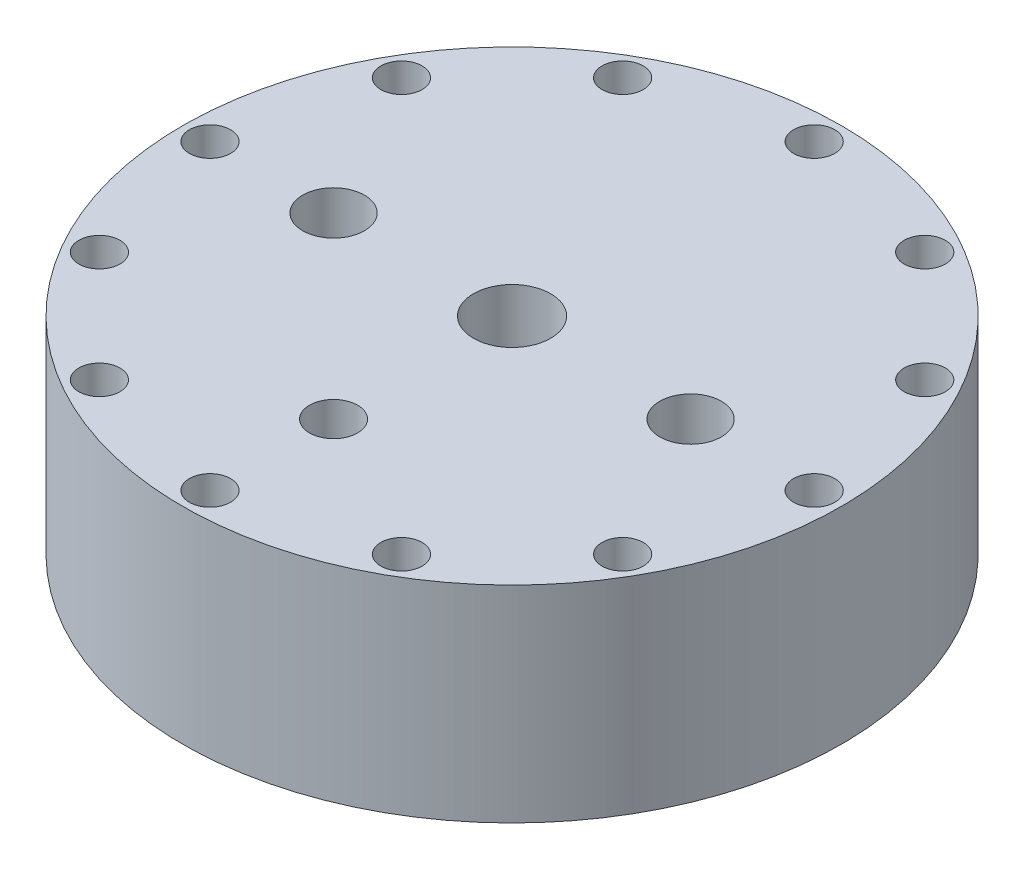
ISO-10303-21;
HEADER;
FILE_DESCRIPTION(('STEP AP214'),'2;1');
FILE_NAME('part.step','',(''),(''),'','','');
FILE_SCHEMA(('AUTOMOTIVE_DESIGN { 1 0 10303 214 1 1 1 1 }'));
ENDSEC;
DATA;
#1=APPLICATION_CONTEXT('core data for automotive mechanical design processes');
#2=APPLICATION_PROTOCOL_DEFINITION('international standard','automotive_design',2000,#1);
#3=PRODUCT_CONTEXT('',#1,'mechanical');
#4=PRODUCT('Part','Part','',(#3));
#5=PRODUCT_RELATED_PRODUCT_CATEGORY('part','',(#4));
#6=PRODUCT_DEFINITION_FORMATION('','',#4);
#7=PRODUCT_DEFINITION_CONTEXT('part definition',#1,'design');
#8=PRODUCT_DEFINITION('design','',#6,#7);
#9=PRODUCT_DEFINITION_SHAPE('','',#8);
#10=(LENGTH_UNIT() NAMED_UNIT(*) SI_UNIT(.MILLI.,.METRE.));
#11=(NAMED_UNIT(*) PLANE_ANGLE_UNIT() SI_UNIT($,.RADIAN.));
#12=(NAMED_UNIT(*) SI_UNIT($,.STERADIAN.) SOLID_ANGLE_UNIT());
#13=UNCERTAINTY_MEASURE_WITH_UNIT(LENGTH_MEASURE(1.E-05),#10,'distance_accuracy_value','');
#14=(GEOMETRIC_REPRESENTATION_CONTEXT(3) GLOBAL_UNCERTAINTY_ASSIGNED_CONTEXT((#13)) GLOBAL_UNIT_ASSIGNED_CONTEXT((#10,
#11,#12)) REPRESENTATION_CONTEXT('',''));
#15=CARTESIAN_POINT('',(0.,0.,0.));
#16=DIRECTION('',(0.,0.,1.));
#17=DIRECTION('',(1.,0.,0.));
#18=AXIS2_PLACEMENT_3D('',#15,#16,#17);
#19=CARTESIAN_POINT('',(0.,0.,0.));
#20=DIRECTION('',(0.,-1.,0.));
#21=DIRECTION('',(0.,0.,-1.));
#22=AXIS2_PLACEMENT_3D('',#19,#20,#21);
#23=PLANE('',#22);
#24=CARTESIAN_POINT('',(0.,0.,41.275));
#25=DIRECTION('',(0.,1.,0.));
#26=DIRECTION('',(0.,0.,1.));
#27=AXIS2_PLACEMENT_3D('',#24,#25,#26);
#28=CIRCLE('',#27,5.5626);
#29=CARTESIAN_POINT('',(0.,0.,46.8376));
#30=VERTEX_POINT('',#29);
#31=EDGE_CURVE('E220',#30,#30,#28,.T.);
#32=ORIENTED_EDGE('',*,*,#31,.F.);
#33=EDGE_LOOP('',(#32));
#34=FACE_BOUND('',#33,.T.);
#35=CARTESIAN_POINT('',(41.275,0.,0.));
#36=DIRECTION('',(0.,1.,0.));
#37=DIRECTION('',(0.,0.,-1.));
#38=AXIS2_PLACEMENT_3D('',#35,#36,#37);
#39=CIRCLE('',#38,7.1374);
#40=CARTESIAN_POINT('',(41.275,0.,-7.1374));
#41=VERTEX_POINT('',#40);
#42=EDGE_CURVE('E212',#41,#41,#39,.T.);
#43=ORIENTED_EDGE('',*,*,#42,.F.);
#44=EDGE_LOOP('',(#43));
#45=FACE_BOUND('',#44,.T.);
#46=CARTESIAN_POINT('',(-41.275,0.,0.));
#47=DIRECTION('',(0.,1.,0.));
#48=DIRECTION('',(0.,0.,1.));
#49=AXIS2_PLACEMENT_3D('',#46,#47,#48);
#50=CIRCLE('',#49,7.1374);
#51=CARTESIAN_POINT('',(-41.275,0.,7.1374));
#52=VERTEX_POINT('',#51);
#53=EDGE_CURVE('E204',#52,#52,#50,.T.);
#54=ORIENTED_EDGE('',*,*,#53,.F.);
#55=EDGE_LOOP('',(#54));
#56=FACE_BOUND('',#55,.T.);
#57=CARTESIAN_POINT('',(0.,0.,0.));
#58=DIRECTION('',(0.,1.,0.));
#59=DIRECTION('',(0.,0.,1.));
#60=AXIS2_PLACEMENT_3D('',#57,#58,#59);
#61=CIRCLE('',#60,8.9281);
#62=CARTESIAN_POINT('',(0.,0.,8.9281));
#63=VERTEX_POINT('',#62);
#64=EDGE_CURVE('E196',#63,#63,#61,.T.);
#65=ORIENTED_EDGE('',*,*,#64,.F.);
#66=EDGE_LOOP('',(#65));
#67=FACE_BOUND('',#66,.T.);
#68=CARTESIAN_POINT('',(-34.9249999999999,0.,-60.4918744543431));
#69=DIRECTION('',(0.,1.,0.));
#70=DIRECTION('',(-0.86602540378444,0.,0.499999999999998));
#71=AXIS2_PLACEMENT_3D('',#68,#69,#70);
#72=CIRCLE('',#71,4.76249999999999);
#73=CARTESIAN_POINT('',(-39.0494459855232,0.,-58.1106244543431));
#74=VERTEX_POINT('',#73);
#75=EDGE_CURVE('E167',#74,#74,#72,.T.);
#76=ORIENTED_EDGE('',*,*,#75,.F.);
#77=EDGE_LOOP('',(#76));
#78=FACE_BOUND('',#77,.T.);
#79=CARTESIAN_POINT('',(2.43879971518193E-13,0.,-69.85));
#80=DIRECTION('',(0.,1.,0.));
#81=DIRECTION('',(-1.,0.,0.));
#82=AXIS2_PLACEMENT_3D('',#79,#80,#81);
#83=CIRCLE('',#82,4.76249999999999);
#84=CARTESIAN_POINT('',(-4.76249999999975,0.,-69.85));
#85=VERTEX_POINT('',#84);
#86=EDGE_CURVE('E159',#85,#85,#83,.T.);
#87=ORIENTED_EDGE('',*,*,#86,.F.);
#88=EDGE_LOOP('',(#87));
#89=FACE_BOUND('',#88,.T.);
#90=CARTESIAN_POINT('',(34.9250000000003,0.,-60.4918744543429));
#91=DIRECTION('',(0.,1.,0.));
#92=DIRECTION('',(-0.866025403784436,0.,-0.500000000000004));
#93=AXIS2_PLACEMENT_3D('',#90,#91,#92);
#94=CIRCLE('',#93,4.76249999999999);
#95=CARTESIAN_POINT('',(30.8005540144769,0.,-62.8731244543429));
#96=VERTEX_POINT('',#95);
#97=EDGE_CURVE('E151',#96,#96,#94,.T.);
#98=ORIENTED_EDGE('',*,*,#97,.F.);
#99=EDGE_LOOP('',(#98));
#100=FACE_BOUND('',#99,.T.);
#101=CARTESIAN_POINT('',(60.4918744543432,0.,-34.9249999999996));
#102=DIRECTION('',(0.,1.,0.));
#103=DIRECTION('',(-0.499999999999995,0.,-0.866025403784442));
#104=AXIS2_PLACEMENT_3D('',#101,#102,#103);
#105=CIRCLE('',#104,4.76249999999999);
#106=CARTESIAN_POINT('',(58.1106244543433,0.,-39.049445985523));
#107=VERTEX_POINT('',#106);
#108=EDGE_CURVE('E143',#107,#107,#105,.T.);
#109=ORIENTED_EDGE('',*,*,#108,.F.);
#110=EDGE_LOOP('',(#109));
#111=FACE_BOUND('',#110,.T.);
#112=CARTESIAN_POINT('',(69.85,0.,0.));
#113=DIRECTION('',(0.,1.,0.));
#114=DIRECTION('',(0.,0.,-1.));
#115=AXIS2_PLACEMENT_3D('',#112,#113,#114);
#116=CIRCLE('',#115,4.76249999999999);
#117=CARTESIAN_POINT('',(69.85,0.,-4.76249999999999));
#118=VERTEX_POINT('',#117);
#119=EDGE_CURVE('E135',#118,#118,#116,.T.);
#120=ORIENTED_EDGE('',*,*,#119,.F.);
#121=EDGE_LOOP('',(#120));
#122=FACE_BOUND('',#121,.T.);
#123=CARTESIAN_POINT('',(60.4918744543427,0.,34.9250000000005));
#124=DIRECTION('',(0.,1.,0.));
#125=DIRECTION('',(0.500000000000007,0.,-0.866025403784435));
#126=AXIS2_PLACEMENT_3D('',#123,#124,#125);
#127=CIRCLE('',#126,4.76249999999999);
#128=CARTESIAN_POINT('',(62.8731244543428,0.,30.8005540144771));
#129=VERTEX_POINT('',#128);
#130=EDGE_CURVE('E127',#129,#129,#127,.T.);
#131=ORIENTED_EDGE('',*,*,#130,.F.);
#132=EDGE_LOOP('',(#131));
#133=FACE_BOUND('',#132,.T.);
#134=CARTESIAN_POINT('',(34.9249999999994,0.,60.4918744543434));
#135=DIRECTION('',(0.,1.,0.));
#136=DIRECTION('',(0.866025403784443,0.,-0.499999999999992));
#137=AXIS2_PLACEMENT_3D('',#134,#135,#136);
#138=CIRCLE('',#137,4.76249999999999);
#139=CARTESIAN_POINT('',(39.0494459855228,0.,58.1106244543434));
#140=VERTEX_POINT('',#139);
#141=EDGE_CURVE('E117',#140,#140,#138,.T.);
#142=ORIENTED_EDGE('',*,*,#141,.F.);
#143=EDGE_LOOP('',(#142));
#144=FACE_BOUND('',#143,.T.);
#145=CARTESIAN_POINT('',(-7.31639914554579E-13,0.,69.85));
#146=DIRECTION('',(0.,1.,0.));
#147=DIRECTION('',(1.,0.,0.));
#148=AXIS2_PLACEMENT_3D('',#145,#146,#147);
#149=CIRCLE('',#148,4.76249999999999);
#150=CARTESIAN_POINT('',(4.76249999999926,0.,69.8500000000001));
#151=VERTEX_POINT('',#150);
#152=EDGE_CURVE('E118',#151,#151,#149,.T.);
#153=ORIENTED_EDGE('',*,*,#152,.F.);
#154=EDGE_LOOP('',(#153));
#155=FACE_BOUND('',#154,.T.);
#156=CARTESIAN_POINT('',(-34.9250000000007,0.,60.4918744543426));
#157=DIRECTION('',(0.,1.,0.));
#158=DIRECTION('',(0.866025403784433,0.,0.50000000000001));
#159=AXIS2_PLACEMENT_3D('',#156,#157,#158);
#160=CIRCLE('',#159,4.76249999999999);
#161=CARTESIAN_POINT('',(-30.8005540144774,0.,62.8731244543427));
#162=VERTEX_POINT('',#161);
#163=EDGE_CURVE('E181',#162,#162,#160,.T.);
#164=ORIENTED_EDGE('',*,*,#163,.F.);
#165=EDGE_LOOP('',(#164));
#166=FACE_BOUND('',#165,.T.);
#167=CARTESIAN_POINT('',(-60.4918744543435,0.,34.9249999999992));
#168=DIRECTION('',(0.,1.,0.));
#169=DIRECTION('',(0.499999999999989,0.,0.866025403784445));
#170=AXIS2_PLACEMENT_3D('',#167,#168,#169);
#171=CIRCLE('',#170,4.76249999999999);
#172=CARTESIAN_POINT('',(-58.1106244543435,0.,39.0494459855226));
#173=VERTEX_POINT('',#172);
#174=EDGE_CURVE('E182',#173,#173,#171,.T.);
#175=ORIENTED_EDGE('',*,*,#174,.F.);
#176=EDGE_LOOP('',(#175));
#177=FACE_BOUND('',#176,.T.);
#178=CARTESIAN_POINT('',(-60.491874454343,0.,-34.9250000000001));
#179=DIRECTION('',(0.,1.,0.));
#180=DIRECTION('',(-0.500000000000001,0.,0.866025403784438));
#181=AXIS2_PLACEMENT_3D('',#178,#179,#180);
#182=CIRCLE('',#181,4.76249999999999);
#183=CARTESIAN_POINT('',(-62.873124454343,0.,-30.8005540144767));
#184=VERTEX_POINT('',#183);
#185=EDGE_CURVE('E108',#184,#184,#182,.T.);
#186=ORIENTED_EDGE('',*,*,#185,.F.);
#187=EDGE_LOOP('',(#186));
#188=FACE_BOUND('',#187,.T.);
#189=CARTESIAN_POINT('',(-69.85,0.,0.));
#190=DIRECTION('',(0.,1.,0.));
#191=DIRECTION('',(0.,0.,1.));
#192=AXIS2_PLACEMENT_3D('',#189,#190,#191);
#193=CIRCLE('',#192,4.76249999999999);
#194=CARTESIAN_POINT('',(-69.85,0.,4.76249999999999));
#195=VERTEX_POINT('',#194);
#196=EDGE_CURVE('E100',#195,#195,#193,.T.);
#197=ORIENTED_EDGE('',*,*,#196,.F.);
#198=EDGE_LOOP('',(#197));
#199=FACE_BOUND('',#198,.T.);
#200=CARTESIAN_POINT('',(0.,0.,0.));
#201=DIRECTION('',(0.,-1.,0.));
#202=DIRECTION('',(0.,0.,-1.));
#203=AXIS2_PLACEMENT_3D('',#200,#201,#202);
#204=CIRCLE('',#203,76.2);
#205=CARTESIAN_POINT('',(0.,0.,-76.2));
#206=VERTEX_POINT('',#205);
#207=EDGE_CURVE('E10',#206,#206,#204,.T.);
#208=ORIENTED_EDGE('',*,*,#207,.F.);
#209=EDGE_LOOP('',(#208));
#210=FACE_BOUND('',#209,.T.);
#211=ADVANCED_FACE('F37',(#34,#45,#56,#67,#78,#89,#100,#111,#122,#133,#144,#155,#166,#177,#188,
#199,#210),#23,.F.);
#212=CARTESIAN_POINT('',(0.,-15.8877,0.));
#213=DIRECTION('',(0.,-1.,0.));
#214=DIRECTION('',(0.,0.,-1.));
#215=AXIS2_PLACEMENT_3D('',#212,#213,#214);
#216=CYLINDRICAL_SURFACE('',#215,76.2);
#217=CARTESIAN_POINT('',(0.,-47.6377,0.));
#218=DIRECTION('',(0.,-1.,0.));
#219=DIRECTION('',(0.,0.,-1.));
#220=AXIS2_PLACEMENT_3D('',#217,#218,#219);
#221=CIRCLE('',#220,76.2);
#222=CARTESIAN_POINT('',(0.,-47.6377,-76.2));
#223=VERTEX_POINT('',#222);
#224=EDGE_CURVE('E44',#223,#223,#221,.T.);
#225=ORIENTED_EDGE('',*,*,#224,.F.);
#226=EDGE_LOOP('',(#225));
#227=FACE_BOUND('',#226,.T.);
#228=ORIENTED_EDGE('',*,*,#207,.T.);
#229=EDGE_LOOP('',(#228));
#230=FACE_BOUND('',#229,.T.);
#231=ADVANCED_FACE('F230',(#227,#230),#216,.T.);
#232=CARTESIAN_POINT('',(-76.2,-47.6377,0.));
#233=DIRECTION('',(0.,1.,0.));
#234=DIRECTION('',(0.,0.,1.));
#235=AXIS2_PLACEMENT_3D('',#232,#233,#234);
#236=PLANE('',#235);
#237=CARTESIAN_POINT('',(-34.9249999999999,-47.6377,-60.4918744543431));
#238=DIRECTION('',(0.,1.,0.));
#239=DIRECTION('',(-0.86602540378444,0.,0.499999999999998));
#240=AXIS2_PLACEMENT_3D('',#237,#238,#239);
#241=CIRCLE('',#240,4.76249999999999);
#242=CARTESIAN_POINT('',(-39.0494459855232,-47.6377,-58.1106244543431));
#243=VERTEX_POINT('',#242);
#244=EDGE_CURVE('E112',#243,#243,#241,.T.);
#245=ORIENTED_EDGE('',*,*,#244,.T.);
#246=EDGE_LOOP('',(#245));
#247=FACE_BOUND('',#246,.T.);
#248=CARTESIAN_POINT('',(2.43879971518193E-13,-47.6377,-69.85));
#249=DIRECTION('',(0.,1.,0.));
#250=DIRECTION('',(-1.,0.,0.));
#251=AXIS2_PLACEMENT_3D('',#248,#249,#250);
#252=CIRCLE('',#251,4.76249999999999);
#253=CARTESIAN_POINT('',(-4.76249999999975,-47.6377,-69.85));
#254=VERTEX_POINT('',#253);
#255=EDGE_CURVE('E163',#254,#254,#252,.T.);
#256=ORIENTED_EDGE('',*,*,#255,.T.);
#257=EDGE_LOOP('',(#256));
#258=FACE_BOUND('',#257,.T.);
#259=CARTESIAN_POINT('',(34.9250000000003,-47.6377,-60.4918744543429));
#260=DIRECTION('',(0.,1.,0.));
#261=DIRECTION('',(-0.866025403784436,0.,-0.500000000000004));
#262=AXIS2_PLACEMENT_3D('',#259,#260,#261);
#263=CIRCLE('',#262,4.76249999999999);
#264=CARTESIAN_POINT('',(30.8005540144769,-47.6377,-62.8731244543429));
#265=VERTEX_POINT('',#264);
#266=EDGE_CURVE('E155',#265,#265,#263,.T.);
#267=ORIENTED_EDGE('',*,*,#266,.T.);
#268=EDGE_LOOP('',(#267));
#269=FACE_BOUND('',#268,.T.);
#270=CARTESIAN_POINT('',(60.4918744543432,-47.6377,-34.9249999999996));
#271=DIRECTION('',(0.,1.,0.));
#272=DIRECTION('',(-0.499999999999995,0.,-0.866025403784442));
#273=AXIS2_PLACEMENT_3D('',#270,#271,#272);
#274=CIRCLE('',#273,4.76249999999999);
#275=CARTESIAN_POINT('',(58.1106244543433,-47.6377,-39.049445985523));
#276=VERTEX_POINT('',#275);
#277=EDGE_CURVE('E147',#276,#276,#274,.T.);
#278=ORIENTED_EDGE('',*,*,#277,.T.);
#279=EDGE_LOOP('',(#278));
#280=FACE_BOUND('',#279,.T.);
#281=CARTESIAN_POINT('',(69.85,-47.6377,0.));
#282=DIRECTION('',(0.,1.,0.));
#283=DIRECTION('',(0.,0.,-1.));
#284=AXIS2_PLACEMENT_3D('',#281,#282,#283);
#285=CIRCLE('',#284,4.76249999999999);
#286=CARTESIAN_POINT('',(69.85,-47.6377,-4.76249999999999));
#287=VERTEX_POINT('',#286);
#288=EDGE_CURVE('E139',#287,#287,#285,.T.);
#289=ORIENTED_EDGE('',*,*,#288,.T.);
#290=EDGE_LOOP('',(#289));
#291=FACE_BOUND('',#290,.T.);
#292=CARTESIAN_POINT('',(60.4918744543427,-47.6377,34.9250000000005));
#293=DIRECTION('',(0.,1.,0.));
#294=DIRECTION('',(0.500000000000007,0.,-0.866025403784435));
#295=AXIS2_PLACEMENT_3D('',#292,#293,#294);
#296=CIRCLE('',#295,4.76249999999999);
#297=CARTESIAN_POINT('',(62.8731244543428,-47.6377,30.8005540144771));
#298=VERTEX_POINT('',#297);
#299=EDGE_CURVE('E131',#298,#298,#296,.T.);
#300=ORIENTED_EDGE('',*,*,#299,.T.);
#301=EDGE_LOOP('',(#300));
#302=FACE_BOUND('',#301,.T.);
#303=CARTESIAN_POINT('',(34.9249999999994,-47.6377,60.4918744543434));
#304=DIRECTION('',(0.,1.,0.));
#305=DIRECTION('',(0.866025403784443,0.,-0.499999999999992));
#306=AXIS2_PLACEMENT_3D('',#303,#304,#305);
#307=CIRCLE('',#306,4.76249999999999);
#308=CARTESIAN_POINT('',(39.0494459855228,-47.6377,58.1106244543434));
#309=VERTEX_POINT('',#308);
#310=EDGE_CURVE('E123',#309,#309,#307,.T.);
#311=ORIENTED_EDGE('',*,*,#310,.T.);
#312=EDGE_LOOP('',(#311));
#313=FACE_BOUND('',#312,.T.);
#314=CARTESIAN_POINT('',(-7.31639914554579E-13,-47.6377,69.85));
#315=DIRECTION('',(0.,1.,0.));
#316=DIRECTION('',(1.,0.,0.));
#317=AXIS2_PLACEMENT_3D('',#314,#315,#316);
#318=CIRCLE('',#317,4.76249999999999);
#319=CARTESIAN_POINT('',(4.76249999999926,-47.6377,69.8500000000001));
#320=VERTEX_POINT('',#319);
#321=EDGE_CURVE('E113',#320,#320,#318,.T.);
#322=ORIENTED_EDGE('',*,*,#321,.T.);
#323=EDGE_LOOP('',(#322));
#324=FACE_BOUND('',#323,.T.);
#325=CARTESIAN_POINT('',(-34.9250000000007,-47.6377,60.4918744543426));
#326=DIRECTION('',(0.,1.,0.));
#327=DIRECTION('',(0.866025403784433,0.,0.50000000000001));
#328=AXIS2_PLACEMENT_3D('',#325,#326,#327);
#329=CIRCLE('',#328,4.76249999999999);
#330=CARTESIAN_POINT('',(-30.8005540144774,-47.6377,62.8731244543427));
#331=VERTEX_POINT('',#330);
#332=EDGE_CURVE('E122',#331,#331,#329,.T.);
#333=ORIENTED_EDGE('',*,*,#332,.T.);
#334=EDGE_LOOP('',(#333));
#335=FACE_BOUND('',#334,.T.);
#336=CARTESIAN_POINT('',(-60.4918744543435,-47.6377,34.9249999999992));
#337=DIRECTION('',(0.,1.,0.));
#338=DIRECTION('',(0.499999999999989,0.,0.866025403784445));
#339=AXIS2_PLACEMENT_3D('',#336,#337,#338);
#340=CIRCLE('',#339,4.76249999999999);
#341=CARTESIAN_POINT('',(-58.1106244543435,-47.6377,39.0494459855226));
#342=VERTEX_POINT('',#341);
#343=EDGE_CURVE('E177',#342,#342,#340,.T.);
#344=ORIENTED_EDGE('',*,*,#343,.T.);
#345=EDGE_LOOP('',(#344));
#346=FACE_BOUND('',#345,.T.);
#347=CARTESIAN_POINT('',(-60.491874454343,-47.6377,-34.9250000000001));
#348=DIRECTION('',(0.,1.,0.));
#349=DIRECTION('',(-0.500000000000001,0.,0.866025403784438));
#350=AXIS2_PLACEMENT_3D('',#347,#348,#349);
#351=CIRCLE('',#350,4.76249999999999);
#352=CARTESIAN_POINT('',(-62.873124454343,-47.6377,-30.8005540144767));
#353=VERTEX_POINT('',#352);
#354=EDGE_CURVE('E104',#353,#353,#351,.T.);
#355=ORIENTED_EDGE('',*,*,#354,.T.);
#356=EDGE_LOOP('',(#355));
#357=FACE_BOUND('',#356,.T.);
#358=CARTESIAN_POINT('',(-69.85,-47.6377,0.));
#359=DIRECTION('',(0.,1.,0.));
#360=DIRECTION('',(0.,0.,1.));
#361=AXIS2_PLACEMENT_3D('',#358,#359,#360);
#362=CIRCLE('',#361,4.76249999999999);
#363=CARTESIAN_POINT('',(-69.85,-47.6377,4.76249999999999));
#364=VERTEX_POINT('',#363);
#365=EDGE_CURVE('E96',#364,#364,#362,.T.);
#366=ORIENTED_EDGE('',*,*,#365,.T.);
#367=EDGE_LOOP('',(#366));
#368=FACE_BOUND('',#367,.T.);
#369=CARTESIAN_POINT('',(0.,-47.6377,0.));
#370=DIRECTION('',(0.,-1.,0.));
#371=DIRECTION('',(0.,0.,-1.));
#372=AXIS2_PLACEMENT_3D('',#369,#370,#371);
#373=CIRCLE('',#372,63.6524);
#374=CARTESIAN_POINT('',(0.,-47.6377,-63.6524));
#375=VERTEX_POINT('',#374);
#376=EDGE_CURVE('E49',#375,#375,#373,.T.);
#377=ORIENTED_EDGE('',*,*,#376,.F.);
#378=EDGE_LOOP('',(#377));
#379=FACE_BOUND('',#378,.T.);
#380=ORIENTED_EDGE('',*,*,#224,.T.);
#381=EDGE_LOOP('',(#380));
#382=FACE_BOUND('',#381,.T.);
#383=ADVANCED_FACE('F270',(#247,#258,#269,#280,#291,#302,#313,#324,#335,#346,#357,#368,#379,
#382),#236,.F.);
#384=CARTESIAN_POINT('',(0.,-15.8877,0.));
#385=DIRECTION('',(0.,-1.,0.));
#386=DIRECTION('',(0.,0.,-1.));
#387=AXIS2_PLACEMENT_3D('',#384,#385,#386);
#388=CYLINDRICAL_SURFACE('',#387,63.6524);
#389=CARTESIAN_POINT('',(0.,-44.9453,0.));
#390=DIRECTION('',(0.,-1.,0.));
#391=DIRECTION('',(0.,0.,-1.));
#392=AXIS2_PLACEMENT_3D('',#389,#390,#391);
#393=CIRCLE('',#392,63.6524);
#394=CARTESIAN_POINT('',(0.,-44.9453,-63.6524));
#395=VERTEX_POINT('',#394);
#396=EDGE_CURVE('E54',#395,#395,#393,.T.);
#397=ORIENTED_EDGE('',*,*,#396,.F.);
#398=EDGE_LOOP('',(#397));
#399=FACE_BOUND('',#398,.T.);
#400=ORIENTED_EDGE('',*,*,#376,.T.);
#401=EDGE_LOOP('',(#400));
#402=FACE_BOUND('',#401,.T.);
#403=ADVANCED_FACE('F273',(#399,#402),#388,.F.);
#404=CARTESIAN_POINT('',(-59.5884,-44.9453,0.));
#405=DIRECTION('',(0.,1.,0.));
#406=DIRECTION('',(0.,0.,1.));
#407=AXIS2_PLACEMENT_3D('',#404,#405,#406);
#408=PLANE('',#407);
#409=CARTESIAN_POINT('',(0.,-44.9453,0.));
#410=DIRECTION('',(0.,-1.,0.));
#411=DIRECTION('',(0.,0.,-1.));
#412=AXIS2_PLACEMENT_3D('',#409,#410,#411);
#413=CIRCLE('',#412,59.5884);
#414=CARTESIAN_POINT('',(0.,-44.9453,-59.5884));
#415=VERTEX_POINT('',#414);
#416=EDGE_CURVE('E60',#415,#415,#413,.T.);
#417=ORIENTED_EDGE('',*,*,#416,.F.);
#418=EDGE_LOOP('',(#417));
#419=FACE_BOUND('',#418,.T.);
#420=ORIENTED_EDGE('',*,*,#396,.T.);
#421=EDGE_LOOP('',(#420));
#422=FACE_BOUND('',#421,.T.);
#423=ADVANCED_FACE('F279',(#419,#422),#408,.F.);
#424=CARTESIAN_POINT('',(0.,-15.8877,0.));
#425=DIRECTION('',(0.,-1.,0.));
#426=DIRECTION('',(0.,0.,-1.));
#427=AXIS2_PLACEMENT_3D('',#424,#425,#426);
#428=CYLINDRICAL_SURFACE('',#427,59.5884);
#429=CARTESIAN_POINT('',(0.,-47.6377,0.));
#430=DIRECTION('',(0.,-1.,0.));
#431=DIRECTION('',(0.,0.,-1.));
#432=AXIS2_PLACEMENT_3D('',#429,#430,#431);
#433=CIRCLE('',#432,59.5884);
#434=CARTESIAN_POINT('',(0.,-47.6377,-59.5884));
#435=VERTEX_POINT('',#434);
#436=EDGE_CURVE('E64',#435,#435,#433,.T.);
#437=ORIENTED_EDGE('',*,*,#436,.F.);
#438=EDGE_LOOP('',(#437));
#439=FACE_BOUND('',#438,.T.);
#440=ORIENTED_EDGE('',*,*,#416,.T.);
#441=EDGE_LOOP('',(#440));
#442=FACE_BOUND('',#441,.T.);
#443=ADVANCED_FACE('F285',(#439,#442),#428,.T.);
#444=CARTESIAN_POINT('',(-57.15,-47.6377,0.));
#445=DIRECTION('',(0.,1.,0.));
#446=DIRECTION('',(0.,0.,1.));
#447=AXIS2_PLACEMENT_3D('',#444,#445,#446);
#448=PLANE('',#447);
#449=CARTESIAN_POINT('',(0.,-47.6377,0.));
#450=DIRECTION('',(0.,-1.,0.));
#451=DIRECTION('',(0.,0.,-1.));
#452=AXIS2_PLACEMENT_3D('',#449,#450,#451);
#453=CIRCLE('',#452,57.15);
#454=CARTESIAN_POINT('',(0.,-47.6377,-57.15));
#455=VERTEX_POINT('',#454);
#456=EDGE_CURVE('E68',#455,#455,#453,.T.);
#457=ORIENTED_EDGE('',*,*,#456,.F.);
#458=EDGE_LOOP('',(#457));
#459=FACE_BOUND('',#458,.T.);
#460=ORIENTED_EDGE('',*,*,#436,.T.);
#461=EDGE_LOOP('',(#460));
#462=FACE_BOUND('',#461,.T.);
#463=ADVANCED_FACE('F502',(#459,#462),#448,.F.);
#464=CARTESIAN_POINT('',(0.,-15.8877,0.));
#465=DIRECTION('',(0.,-1.,0.));
#466=DIRECTION('',(0.,0.,-1.));
#467=AXIS2_PLACEMENT_3D('',#464,#465,#466);
#468=CYLINDRICAL_SURFACE('',#467,57.15);
#469=CARTESIAN_POINT('',(0.,-41.2877,0.));
#470=DIRECTION('',(0.,-1.,0.));
#471=DIRECTION('',(0.,0.,-1.));
#472=AXIS2_PLACEMENT_3D('',#469,#470,#471);
#473=CIRCLE('',#472,57.15);
#474=CARTESIAN_POINT('',(0.,-41.2877,-57.15));
#475=VERTEX_POINT('',#474);
#476=EDGE_CURVE('E72',#475,#475,#473,.T.);
#477=ORIENTED_EDGE('',*,*,#476,.F.);
#478=EDGE_LOOP('',(#477));
#479=FACE_BOUND('',#478,.T.);
#480=ORIENTED_EDGE('',*,*,#456,.T.);
#481=EDGE_LOOP('',(#480));
#482=FACE_BOUND('',#481,.T.);
#483=ADVANCED_FACE('F498',(#479,#482),#468,.F.);
#484=CARTESIAN_POINT('',(-57.15,-41.2877,0.));
#485=DIRECTION('',(0.,1.,0.));
#486=DIRECTION('',(0.,0.,1.));
#487=AXIS2_PLACEMENT_3D('',#484,#485,#486);
#488=PLANE('',#487);
#489=CARTESIAN_POINT('',(0.,-41.2877,0.));
#490=DIRECTION('',(0.,-1.,0.));
#491=DIRECTION('',(0.,0.,-1.));
#492=AXIS2_PLACEMENT_3D('',#489,#490,#491);
#493=CIRCLE('',#492,50.8);
#494=CARTESIAN_POINT('',(0.,-41.2877,-50.8));
#495=VERTEX_POINT('',#494);
#496=EDGE_CURVE('E76',#495,#495,#493,.T.);
#497=ORIENTED_EDGE('',*,*,#496,.F.);
#498=EDGE_LOOP('',(#497));
#499=FACE_BOUND('',#498,.T.);
#500=ORIENTED_EDGE('',*,*,#476,.T.);
#501=EDGE_LOOP('',(#500));
#502=FACE_BOUND('',#501,.T.);
#503=ADVANCED_FACE('F494',(#499,#502),#488,.F.);
#504=CARTESIAN_POINT('',(0.,-15.8877,0.));
#505=DIRECTION('',(0.,-1.,0.));
#506=DIRECTION('',(0.,0.,-1.));
#507=AXIS2_PLACEMENT_3D('',#504,#505,#506);
#508=CYLINDRICAL_SURFACE('',#507,50.8);
#509=CARTESIAN_POINT('',(0.,-28.5877,0.));
#510=DIRECTION('',(0.,-1.,0.));
#511=DIRECTION('',(0.,0.,-1.));
#512=AXIS2_PLACEMENT_3D('',#509,#510,#511);
#513=CIRCLE('',#512,50.8);
#514=CARTESIAN_POINT('',(0.,-28.5877,-50.8));
#515=VERTEX_POINT('',#514);
#516=EDGE_CURVE('E80',#515,#515,#513,.T.);
#517=ORIENTED_EDGE('',*,*,#516,.F.);
#518=EDGE_LOOP('',(#517));
#519=FACE_BOUND('',#518,.T.);
#520=ORIENTED_EDGE('',*,*,#496,.T.);
#521=EDGE_LOOP('',(#520));
#522=FACE_BOUND('',#521,.T.);
#523=ADVANCED_FACE('F473',(#519,#522),#508,.F.);
#524=CARTESIAN_POINT('',(-50.8,-28.5877,0.));
#525=DIRECTION('',(0.,1.,0.));
#526=DIRECTION('',(0.,0.,1.));
#527=AXIS2_PLACEMENT_3D('',#524,#525,#526);
#528=PLANE('',#527);
#529=CARTESIAN_POINT('',(0.,-28.5877,41.275));
#530=DIRECTION('',(0.,1.,0.));
#531=DIRECTION('',(0.,0.,1.));
#532=AXIS2_PLACEMENT_3D('',#529,#530,#531);
#533=CIRCLE('',#532,5.5626);
#534=CARTESIAN_POINT('',(0.,-28.5877,46.8376));
#535=VERTEX_POINT('',#534);
#536=EDGE_CURVE('E216',#535,#535,#533,.T.);
#537=ORIENTED_EDGE('',*,*,#536,.T.);
#538=EDGE_LOOP('',(#537));
#539=FACE_BOUND('',#538,.T.);
#540=CARTESIAN_POINT('',(41.275,-28.5877,0.));
#541=DIRECTION('',(0.,1.,0.));
#542=DIRECTION('',(0.,0.,-1.));
#543=AXIS2_PLACEMENT_3D('',#540,#541,#542);
#544=CIRCLE('',#543,7.1374);
#545=CARTESIAN_POINT('',(41.275,-28.5877,-7.1374));
#546=VERTEX_POINT('',#545);
#547=EDGE_CURVE('E208',#546,#546,#544,.T.);
#548=ORIENTED_EDGE('',*,*,#547,.T.);
#549=EDGE_LOOP('',(#548));
#550=FACE_BOUND('',#549,.T.);
#551=CARTESIAN_POINT('',(-41.275,-28.5877,0.));
#552=DIRECTION('',(0.,1.,0.));
#553=DIRECTION('',(0.,0.,1.));
#554=AXIS2_PLACEMENT_3D('',#551,#552,#553);
#555=CIRCLE('',#554,7.1374);
#556=CARTESIAN_POINT('',(-41.275,-28.5877,7.1374));
#557=VERTEX_POINT('',#556);
#558=EDGE_CURVE('E200',#557,#557,#555,.T.);
#559=ORIENTED_EDGE('',*,*,#558,.T.);
#560=EDGE_LOOP('',(#559));
#561=FACE_BOUND('',#560,.T.);
#562=CARTESIAN_POINT('',(0.,-28.5877,0.));
#563=DIRECTION('',(0.,-1.,0.));
#564=DIRECTION('',(0.,0.,-1.));
#565=AXIS2_PLACEMENT_3D('',#562,#563,#564);
#566=CIRCLE('',#565,25.4);
#567=CARTESIAN_POINT('',(0.,-28.5877,-25.4));
#568=VERTEX_POINT('',#567);
#569=EDGE_CURVE('E84',#568,#568,#566,.T.);
#570=ORIENTED_EDGE('',*,*,#569,.F.);
#571=EDGE_LOOP('',(#570));
#572=FACE_BOUND('',#571,.T.);
#573=ORIENTED_EDGE('',*,*,#516,.T.);
#574=EDGE_LOOP('',(#573));
#575=FACE_BOUND('',#574,.T.);
#576=ADVANCED_FACE('F467',(#539,#550,#561,#572,#575),#528,.F.);
#577=CARTESIAN_POINT('',(0.,-15.8877,0.));
#578=DIRECTION('',(0.,-1.,0.));
#579=DIRECTION('',(0.,0.,-1.));
#580=AXIS2_PLACEMENT_3D('',#577,#578,#579);
#581=CYLINDRICAL_SURFACE('',#580,25.4);
#582=CARTESIAN_POINT('',(0.,-22.2377,0.));
#583=DIRECTION('',(0.,-1.,0.));
#584=DIRECTION('',(0.,0.,-1.));
#585=AXIS2_PLACEMENT_3D('',#582,#583,#584);
#586=CIRCLE('',#585,25.4);
#587=CARTESIAN_POINT('',(0.,-22.2377,-25.4));
#588=VERTEX_POINT('',#587);
#589=EDGE_CURVE('E88',#588,#588,#586,.T.);
#590=ORIENTED_EDGE('',*,*,#589,.F.);
#591=EDGE_LOOP('',(#590));
#592=FACE_BOUND('',#591,.T.);
#593=ORIENTED_EDGE('',*,*,#569,.T.);
#594=EDGE_LOOP('',(#593));
#595=FACE_BOUND('',#594,.T.);
#596=ADVANCED_FACE('F472',(#592,#595),#581,.F.);
#597=CARTESIAN_POINT('',(0.,-22.2377,0.));
#598=DIRECTION('',(0.,-1.,0.));
#599=DIRECTION('',(0.,0.,-1.));
#600=AXIS2_PLACEMENT_3D('',#597,#598,#599);
#601=CONICAL_SURFACE('',#600,25.4,1.10714871779409);
#602=CARTESIAN_POINT('',(0.,-15.8877,0.));
#603=DIRECTION('',(0.,-1.,0.));
#604=DIRECTION('',(0.,0.,-1.));
#605=AXIS2_PLACEMENT_3D('',#602,#603,#604);
#606=CIRCLE('',#605,12.7);
#607=CARTESIAN_POINT('',(0.,-15.8877,-12.7));
#608=VERTEX_POINT('',#607);
#609=EDGE_CURVE('E92',#608,#608,#606,.T.);
#610=ORIENTED_EDGE('',*,*,#609,.F.);
#611=EDGE_LOOP('',(#610));
#612=FACE_BOUND('',#611,.T.);
#613=ORIENTED_EDGE('',*,*,#589,.T.);
#614=EDGE_LOOP('',(#613));
#615=FACE_BOUND('',#614,.T.);
#616=ADVANCED_FACE('F426',(#612,#615),#601,.F.);
#617=CARTESIAN_POINT('',(-12.7,-15.8877,0.));
#618=DIRECTION('',(0.,1.,0.));
#619=DIRECTION('',(0.,0.,1.));
#620=AXIS2_PLACEMENT_3D('',#617,#618,#619);
#621=PLANE('',#620);
#622=CARTESIAN_POINT('',(0.,-15.8877,0.));
#623=DIRECTION('',(0.,1.,0.));
#624=DIRECTION('',(0.,0.,1.));
#625=AXIS2_PLACEMENT_3D('',#622,#623,#624);
#626=CIRCLE('',#625,8.9281);
#627=CARTESIAN_POINT('',(0.,-15.8877,8.9281));
#628=VERTEX_POINT('',#627);
#629=EDGE_CURVE('E186',#628,#628,#626,.T.);
#630=ORIENTED_EDGE('',*,*,#629,.T.);
#631=EDGE_LOOP('',(#630));
#632=FACE_BOUND('',#631,.T.);
#633=ORIENTED_EDGE('',*,*,#609,.T.);
#634=EDGE_LOOP('',(#633));
#635=FACE_BOUND('',#634,.T.);
#636=ADVANCED_FACE('F266',(#632,#635),#621,.F.);
#637=CARTESIAN_POINT('',(-69.85,0.,0.));
#638=DIRECTION('',(0.,1.,0.));
#639=DIRECTION('',(0.,0.,1.));
#640=AXIS2_PLACEMENT_3D('',#637,#638,#639);
#641=CYLINDRICAL_SURFACE('',#640,4.76249999999999);
#642=ORIENTED_EDGE('',*,*,#196,.T.);
#643=EDGE_LOOP('',(#642));
#644=FACE_BOUND('',#643,.T.);
#645=ORIENTED_EDGE('',*,*,#365,.F.);
#646=EDGE_LOOP('',(#645));
#647=FACE_BOUND('',#646,.T.);
#648=ADVANCED_FACE('F262',(#644,#647),#641,.F.);
#649=CARTESIAN_POINT('',(-60.491874454343,0.,-34.9250000000001));
#650=DIRECTION('',(0.,1.,0.));
#651=DIRECTION('',(-0.500000000000001,0.,0.866025403784438));
#652=AXIS2_PLACEMENT_3D('',#649,#650,#651);
#653=CYLINDRICAL_SURFACE('',#652,4.76249999999999);
#654=ORIENTED_EDGE('',*,*,#185,.T.);
#655=EDGE_LOOP('',(#654));
#656=FACE_BOUND('',#655,.T.);
#657=ORIENTED_EDGE('',*,*,#354,.F.);
#658=EDGE_LOOP('',(#657));
#659=FACE_BOUND('',#658,.T.);
#660=ADVANCED_FACE('F265',(#656,#659),#653,.F.);
#661=CARTESIAN_POINT('',(-60.4918744543435,0.,34.9249999999992));
#662=DIRECTION('',(0.,1.,0.));
#663=DIRECTION('',(0.499999999999989,0.,0.866025403784445));
#664=AXIS2_PLACEMENT_3D('',#661,#662,#663);
#665=CYLINDRICAL_SURFACE('',#664,4.76249999999999);
#666=ORIENTED_EDGE('',*,*,#174,.T.);
#667=EDGE_LOOP('',(#666));
#668=FACE_BOUND('',#667,.T.);
#669=ORIENTED_EDGE('',*,*,#343,.F.);
#670=EDGE_LOOP('',(#669));
#671=FACE_BOUND('',#670,.T.);
#672=ADVANCED_FACE('F314',(#668,#671),#665,.F.);
#673=CARTESIAN_POINT('',(-34.9250000000007,0.,60.4918744543426));
#674=DIRECTION('',(0.,1.,0.));
#675=DIRECTION('',(0.866025403784433,0.,0.50000000000001));
#676=AXIS2_PLACEMENT_3D('',#673,#674,#675);
#677=CYLINDRICAL_SURFACE('',#676,4.76249999999999);
#678=ORIENTED_EDGE('',*,*,#163,.T.);
#679=EDGE_LOOP('',(#678));
#680=FACE_BOUND('',#679,.T.);
#681=ORIENTED_EDGE('',*,*,#332,.F.);
#682=EDGE_LOOP('',(#681));
#683=FACE_BOUND('',#682,.T.);
#684=ADVANCED_FACE('F324',(#680,#683),#677,.F.);
#685=CARTESIAN_POINT('',(-7.31639914554579E-13,0.,69.85));
#686=DIRECTION('',(0.,1.,0.));
#687=DIRECTION('',(1.,0.,0.));
#688=AXIS2_PLACEMENT_3D('',#685,#686,#687);
#689=CYLINDRICAL_SURFACE('',#688,4.76249999999999);
#690=ORIENTED_EDGE('',*,*,#152,.T.);
#691=EDGE_LOOP('',(#690));
#692=FACE_BOUND('',#691,.T.);
#693=ORIENTED_EDGE('',*,*,#321,.F.);
#694=EDGE_LOOP('',(#693));
#695=FACE_BOUND('',#694,.T.);
#696=ADVANCED_FACE('F334',(#692,#695),#689,.F.);
#697=CARTESIAN_POINT('',(34.9249999999994,0.,60.4918744543434));
#698=DIRECTION('',(0.,1.,0.));
#699=DIRECTION('',(0.866025403784443,0.,-0.499999999999992));
#700=AXIS2_PLACEMENT_3D('',#697,#698,#699);
#701=CYLINDRICAL_SURFACE('',#700,4.76249999999999);
#702=ORIENTED_EDGE('',*,*,#141,.T.);
#703=EDGE_LOOP('',(#702));
#704=FACE_BOUND('',#703,.T.);
#705=ORIENTED_EDGE('',*,*,#310,.F.);
#706=EDGE_LOOP('',(#705));
#707=FACE_BOUND('',#706,.T.);
#708=ADVANCED_FACE('F344',(#704,#707),#701,.F.);
#709=CARTESIAN_POINT('',(60.4918744543427,0.,34.9250000000005));
#710=DIRECTION('',(0.,1.,0.));
#711=DIRECTION('',(0.500000000000007,0.,-0.866025403784435));
#712=AXIS2_PLACEMENT_3D('',#709,#710,#711);
#713=CYLINDRICAL_SURFACE('',#712,4.76249999999999);
#714=ORIENTED_EDGE('',*,*,#130,.T.);
#715=EDGE_LOOP('',(#714));
#716=FACE_BOUND('',#715,.T.);
#717=ORIENTED_EDGE('',*,*,#299,.F.);
#718=EDGE_LOOP('',(#717));
#719=FACE_BOUND('',#718,.T.);
#720=ADVANCED_FACE('F354',(#716,#719),#713,.F.);
#721=CARTESIAN_POINT('',(69.85,0.,0.));
#722=DIRECTION('',(0.,1.,0.));
#723=DIRECTION('',(0.,0.,-1.));
#724=AXIS2_PLACEMENT_3D('',#721,#722,#723);
#725=CYLINDRICAL_SURFACE('',#724,4.76249999999999);
#726=ORIENTED_EDGE('',*,*,#119,.T.);
#727=EDGE_LOOP('',(#726));
#728=FACE_BOUND('',#727,.T.);
#729=ORIENTED_EDGE('',*,*,#288,.F.);
#730=EDGE_LOOP('',(#729));
#731=FACE_BOUND('',#730,.T.);
#732=ADVANCED_FACE('F364',(#728,#731),#725,.F.);
#733=CARTESIAN_POINT('',(60.4918744543432,0.,-34.9249999999996));
#734=DIRECTION('',(0.,1.,0.));
#735=DIRECTION('',(-0.499999999999995,0.,-0.866025403784442));
#736=AXIS2_PLACEMENT_3D('',#733,#734,#735);
#737=CYLINDRICAL_SURFACE('',#736,4.76249999999999);
#738=ORIENTED_EDGE('',*,*,#108,.T.);
#739=EDGE_LOOP('',(#738));
#740=FACE_BOUND('',#739,.T.);
#741=ORIENTED_EDGE('',*,*,#277,.F.);
#742=EDGE_LOOP('',(#741));
#743=FACE_BOUND('',#742,.T.);
#744=ADVANCED_FACE('F374',(#740,#743),#737,.F.);
#745=CARTESIAN_POINT('',(34.9250000000003,0.,-60.4918744543429));
#746=DIRECTION('',(0.,1.,0.));
#747=DIRECTION('',(-0.866025403784436,0.,-0.500000000000004));
#748=AXIS2_PLACEMENT_3D('',#745,#746,#747);
#749=CYLINDRICAL_SURFACE('',#748,4.76249999999999);
#750=ORIENTED_EDGE('',*,*,#97,.T.);
#751=EDGE_LOOP('',(#750));
#752=FACE_BOUND('',#751,.T.);
#753=ORIENTED_EDGE('',*,*,#266,.F.);
#754=EDGE_LOOP('',(#753));
#755=FACE_BOUND('',#754,.T.);
#756=ADVANCED_FACE('F384',(#752,#755),#749,.F.);
#757=CARTESIAN_POINT('',(2.43879971518193E-13,0.,-69.85));
#758=DIRECTION('',(0.,1.,0.));
#759=DIRECTION('',(-1.,0.,0.));
#760=AXIS2_PLACEMENT_3D('',#757,#758,#759);
#761=CYLINDRICAL_SURFACE('',#760,4.76249999999999);
#762=ORIENTED_EDGE('',*,*,#86,.T.);
#763=EDGE_LOOP('',(#762));
#764=FACE_BOUND('',#763,.T.);
#765=ORIENTED_EDGE('',*,*,#255,.F.);
#766=EDGE_LOOP('',(#765));
#767=FACE_BOUND('',#766,.T.);
#768=ADVANCED_FACE('F394',(#764,#767),#761,.F.);
#769=CARTESIAN_POINT('',(-34.9249999999999,0.,-60.4918744543431));
#770=DIRECTION('',(0.,1.,0.));
#771=DIRECTION('',(-0.86602540378444,0.,0.499999999999998));
#772=AXIS2_PLACEMENT_3D('',#769,#770,#771);
#773=CYLINDRICAL_SURFACE('',#772,4.76249999999999);
#774=ORIENTED_EDGE('',*,*,#75,.T.);
#775=EDGE_LOOP('',(#774));
#776=FACE_BOUND('',#775,.T.);
#777=ORIENTED_EDGE('',*,*,#244,.F.);
#778=EDGE_LOOP('',(#777));
#779=FACE_BOUND('',#778,.T.);
#780=ADVANCED_FACE('F404',(#776,#779),#773,.F.);
#781=CARTESIAN_POINT('',(0.,0.,0.));
#782=DIRECTION('',(0.,1.,0.));
#783=DIRECTION('',(0.,0.,1.));
#784=AXIS2_PLACEMENT_3D('',#781,#782,#783);
#785=CYLINDRICAL_SURFACE('',#784,8.9281);
#786=ORIENTED_EDGE('',*,*,#64,.T.);
#787=EDGE_LOOP('',(#786));
#788=FACE_BOUND('',#787,.T.);
#789=ORIENTED_EDGE('',*,*,#629,.F.);
#790=EDGE_LOOP('',(#789));
#791=FACE_BOUND('',#790,.T.);
#792=ADVANCED_FACE('F414',(#788,#791),#785,.F.);
#793=CARTESIAN_POINT('',(-41.275,0.,0.));
#794=DIRECTION('',(0.,1.,0.));
#795=DIRECTION('',(0.,0.,1.));
#796=AXIS2_PLACEMENT_3D('',#793,#794,#795);
#797=CYLINDRICAL_SURFACE('',#796,7.1374);
#798=ORIENTED_EDGE('',*,*,#53,.T.);
#799=EDGE_LOOP('',(#798));
#800=FACE_BOUND('',#799,.T.);
#801=ORIENTED_EDGE('',*,*,#558,.F.);
#802=EDGE_LOOP('',(#801));
#803=FACE_BOUND('',#802,.T.);
#804=ADVANCED_FACE('F436',(#800,#803),#797,.F.);
#805=CARTESIAN_POINT('',(41.275,0.,0.));
#806=DIRECTION('',(0.,1.,0.));
#807=DIRECTION('',(0.,0.,-1.));
#808=AXIS2_PLACEMENT_3D('',#805,#806,#807);
#809=CYLINDRICAL_SURFACE('',#808,7.1374);
#810=ORIENTED_EDGE('',*,*,#42,.T.);
#811=EDGE_LOOP('',(#810));
#812=FACE_BOUND('',#811,.T.);
#813=ORIENTED_EDGE('',*,*,#547,.F.);
#814=EDGE_LOOP('',(#813));
#815=FACE_BOUND('',#814,.T.);
#816=ADVANCED_FACE('F446',(#812,#815),#809,.F.);
#817=CARTESIAN_POINT('',(0.,0.,41.275));
#818=DIRECTION('',(0.,1.,0.));
#819=DIRECTION('',(0.,0.,1.));
#820=AXIS2_PLACEMENT_3D('',#817,#818,#819);
#821=CYLINDRICAL_SURFACE('',#820,5.5626);
#822=ORIENTED_EDGE('',*,*,#31,.T.);
#823=EDGE_LOOP('',(#822));
#824=FACE_BOUND('',#823,.T.);
#825=ORIENTED_EDGE('',*,*,#536,.F.);
#826=EDGE_LOOP('',(#825));
#827=FACE_BOUND('',#826,.T.);
#828=ADVANCED_FACE('F225',(#824,#827),#821,.F.);
#829=CLOSED_SHELL('',(#211,#231,#383,#403,#423,#443,#463,#483,#503,#523,#576,#596,#616,#636,
#648,#660,#672,#684,#696,#708,#720,#732,#744,#756,#768,#780,#792,#804,#816,#828));
#830=MANIFOLD_SOLID_BREP('B2',#829);
#831=ADVANCED_BREP_SHAPE_REPRESENTATION('',(#18,#830),#14);
#832=SHAPE_DEFINITION_REPRESENTATION(#9,#831);
ENDSEC;
END-ISO-10303-21;
